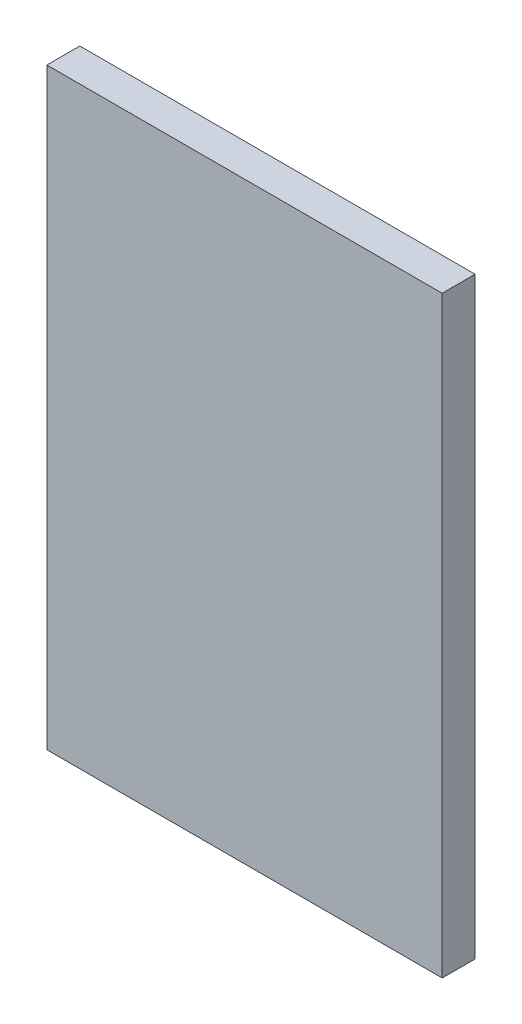
ISO-10303-21;
HEADER;
FILE_DESCRIPTION(('STEP AP214'),'2;1');
FILE_NAME('part.step','',(''),(''),'','','');
FILE_SCHEMA(('AUTOMOTIVE_DESIGN { 1 0 10303 214 1 1 1 1 }'));
ENDSEC;
DATA;
#1=APPLICATION_CONTEXT('core data for automotive mechanical design processes');
#2=APPLICATION_PROTOCOL_DEFINITION('international standard','automotive_design',2000,#1);
#3=PRODUCT_CONTEXT('',#1,'mechanical');
#4=PRODUCT('Part','Part','',(#3));
#5=PRODUCT_RELATED_PRODUCT_CATEGORY('part','',(#4));
#6=PRODUCT_DEFINITION_FORMATION('','',#4);
#7=PRODUCT_DEFINITION_CONTEXT('part definition',#1,'design');
#8=PRODUCT_DEFINITION('design','',#6,#7);
#9=PRODUCT_DEFINITION_SHAPE('','',#8);
#10=(LENGTH_UNIT() NAMED_UNIT(*) SI_UNIT(.MILLI.,.METRE.));
#11=(NAMED_UNIT(*) PLANE_ANGLE_UNIT() SI_UNIT($,.RADIAN.));
#12=(NAMED_UNIT(*) SI_UNIT($,.STERADIAN.) SOLID_ANGLE_UNIT());
#13=UNCERTAINTY_MEASURE_WITH_UNIT(LENGTH_MEASURE(1.E-05),#10,'distance_accuracy_value','');
#14=(GEOMETRIC_REPRESENTATION_CONTEXT(3) GLOBAL_UNCERTAINTY_ASSIGNED_CONTEXT((#13)) GLOBAL_UNIT_ASSIGNED_CONTEXT((#10,
#11,#12)) REPRESENTATION_CONTEXT('',''));
#15=CARTESIAN_POINT('',(0.,0.,0.));
#16=DIRECTION('',(0.,0.,1.));
#17=DIRECTION('',(1.,0.,0.));
#18=AXIS2_PLACEMENT_3D('',#15,#16,#17);
#19=CARTESIAN_POINT('',(30.,-45.,5.));
#20=DIRECTION('',(-1.,0.,0.));
#21=DIRECTION('',(0.,0.,1.));
#22=AXIS2_PLACEMENT_3D('',#19,#20,#21);
#23=PLANE('',#22);
#24=DIRECTION('',(0.,1.,0.));
#25=VECTOR('',#24,1.);
#26=CARTESIAN_POINT('',(30.,-45.,0.));
#27=LINE('',#26,#25);
#28=CARTESIAN_POINT('',(30.,-45.,0.));
#29=VERTEX_POINT('',#28);
#30=CARTESIAN_POINT('',(30.,45.,0.));
#31=VERTEX_POINT('',#30);
#32=EDGE_CURVE('E101',#29,#31,#27,.T.);
#33=ORIENTED_EDGE('',*,*,#32,.T.);
#34=DIRECTION('',(0.,0.,-1.));
#35=VECTOR('',#34,1.);
#36=CARTESIAN_POINT('',(30.,45.,5.));
#37=LINE('',#36,#35);
#38=CARTESIAN_POINT('',(30.,45.,5.));
#39=VERTEX_POINT('',#38);
#40=EDGE_CURVE('E11',#39,#31,#37,.T.);
#41=ORIENTED_EDGE('',*,*,#40,.F.);
#42=DIRECTION('',(0.,1.,0.));
#43=VECTOR('',#42,1.);
#44=CARTESIAN_POINT('',(30.,-45.,5.));
#45=LINE('',#44,#43);
#46=CARTESIAN_POINT('',(30.,-45.,5.));
#47=VERTEX_POINT('',#46);
#48=EDGE_CURVE('E89',#47,#39,#45,.T.);
#49=ORIENTED_EDGE('',*,*,#48,.F.);
#50=DIRECTION('',(0.,0.,-1.));
#51=VECTOR('',#50,1.);
#52=CARTESIAN_POINT('',(30.,-45.,5.));
#53=LINE('',#52,#51);
#54=EDGE_CURVE('E97',#47,#29,#53,.T.);
#55=ORIENTED_EDGE('',*,*,#54,.T.);
#56=EDGE_LOOP('',(#33,#41,#49,#55));
#57=FACE_BOUND('',#56,.T.);
#58=ADVANCED_FACE('F38',(#57),#23,.F.);
#59=CARTESIAN_POINT('',(-30.,45.,5.));
#60=DIRECTION('',(0.,-1.,0.));
#61=DIRECTION('',(0.,0.,-1.));
#62=AXIS2_PLACEMENT_3D('',#59,#60,#61);
#63=PLANE('',#62);
#64=DIRECTION('',(-1.,0.,0.));
#65=VECTOR('',#64,1.);
#66=CARTESIAN_POINT('',(-30.,45.,0.));
#67=LINE('',#66,#65);
#68=CARTESIAN_POINT('',(-30.,45.,0.));
#69=VERTEX_POINT('',#68);
#70=EDGE_CURVE('E93',#31,#69,#67,.T.);
#71=ORIENTED_EDGE('',*,*,#70,.T.);
#72=DIRECTION('',(0.,0.,-1.));
#73=VECTOR('',#72,1.);
#74=CARTESIAN_POINT('',(-30.,45.,5.));
#75=LINE('',#74,#73);
#76=CARTESIAN_POINT('',(-30.,45.,5.));
#77=VERTEX_POINT('',#76);
#78=EDGE_CURVE('E46',#77,#69,#75,.T.);
#79=ORIENTED_EDGE('',*,*,#78,.F.);
#80=DIRECTION('',(-1.,0.,0.));
#81=VECTOR('',#80,1.);
#82=CARTESIAN_POINT('',(-30.,45.,5.));
#83=LINE('',#82,#81);
#84=EDGE_CURVE('E84',#39,#77,#83,.T.);
#85=ORIENTED_EDGE('',*,*,#84,.F.);
#86=ORIENTED_EDGE('',*,*,#40,.T.);
#87=EDGE_LOOP('',(#71,#79,#85,#86));
#88=FACE_BOUND('',#87,.T.);
#89=ADVANCED_FACE('F92',(#88),#63,.F.);
#90=CARTESIAN_POINT('',(-30.,-45.,5.));
#91=DIRECTION('',(1.,0.,0.));
#92=DIRECTION('',(0.,0.,-1.));
#93=AXIS2_PLACEMENT_3D('',#90,#91,#92);
#94=PLANE('',#93);
#95=DIRECTION('',(0.,-1.,0.));
#96=VECTOR('',#95,1.);
#97=CARTESIAN_POINT('',(-30.,-45.,0.));
#98=LINE('',#97,#96);
#99=CARTESIAN_POINT('',(-30.,-45.,0.));
#100=VERTEX_POINT('',#99);
#101=EDGE_CURVE('E71',#69,#100,#98,.T.);
#102=ORIENTED_EDGE('',*,*,#101,.T.);
#103=DIRECTION('',(0.,0.,-1.));
#104=VECTOR('',#103,1.);
#105=CARTESIAN_POINT('',(-30.,-45.,5.));
#106=LINE('',#105,#104);
#107=CARTESIAN_POINT('',(-30.,-45.,5.));
#108=VERTEX_POINT('',#107);
#109=EDGE_CURVE('E94',#108,#100,#106,.T.);
#110=ORIENTED_EDGE('',*,*,#109,.F.);
#111=DIRECTION('',(0.,-1.,0.));
#112=VECTOR('',#111,1.);
#113=CARTESIAN_POINT('',(-30.,-45.,5.));
#114=LINE('',#113,#112);
#115=EDGE_CURVE('E87',#77,#108,#114,.T.);
#116=ORIENTED_EDGE('',*,*,#115,.F.);
#117=ORIENTED_EDGE('',*,*,#78,.T.);
#118=EDGE_LOOP('',(#102,#110,#116,#117));
#119=FACE_BOUND('',#118,.T.);
#120=ADVANCED_FACE('F95',(#119),#94,.F.);
#121=CARTESIAN_POINT('',(-30.,-45.,5.));
#122=DIRECTION('',(0.,1.,0.));
#123=DIRECTION('',(0.,0.,1.));
#124=AXIS2_PLACEMENT_3D('',#121,#122,#123);
#125=PLANE('',#124);
#126=DIRECTION('',(1.,0.,0.));
#127=VECTOR('',#126,1.);
#128=CARTESIAN_POINT('',(-30.,-45.,0.));
#129=LINE('',#128,#127);
#130=EDGE_CURVE('E77',#100,#29,#129,.T.);
#131=ORIENTED_EDGE('',*,*,#130,.T.);
#132=ORIENTED_EDGE('',*,*,#54,.F.);
#133=DIRECTION('',(1.,0.,0.));
#134=VECTOR('',#133,1.);
#135=CARTESIAN_POINT('',(-30.,-45.,5.));
#136=LINE('',#135,#134);
#137=EDGE_CURVE('E54',#108,#47,#136,.T.);
#138=ORIENTED_EDGE('',*,*,#137,.F.);
#139=ORIENTED_EDGE('',*,*,#109,.T.);
#140=EDGE_LOOP('',(#131,#132,#138,#139));
#141=FACE_BOUND('',#140,.T.);
#142=ADVANCED_FACE('F108',(#141),#125,.F.);
#143=CARTESIAN_POINT('',(0.,0.,5.));
#144=DIRECTION('',(0.,0.,-1.));
#145=DIRECTION('',(-1.,0.,0.));
#146=AXIS2_PLACEMENT_3D('',#143,#144,#145);
#147=PLANE('',#146);
#148=ORIENTED_EDGE('',*,*,#48,.T.);
#149=ORIENTED_EDGE('',*,*,#84,.T.);
#150=ORIENTED_EDGE('',*,*,#115,.T.);
#151=ORIENTED_EDGE('',*,*,#137,.T.);
#152=EDGE_LOOP('',(#148,#149,#150,#151));
#153=FACE_BOUND('',#152,.T.);
#154=ADVANCED_FACE('F85',(#153),#147,.F.);
#155=CARTESIAN_POINT('',(0.,0.,0.));
#156=DIRECTION('',(0.,0.,-1.));
#157=DIRECTION('',(-1.,0.,0.));
#158=AXIS2_PLACEMENT_3D('',#155,#156,#157);
#159=PLANE('',#158);
#160=ORIENTED_EDGE('',*,*,#32,.F.);
#161=ORIENTED_EDGE('',*,*,#130,.F.);
#162=ORIENTED_EDGE('',*,*,#101,.F.);
#163=ORIENTED_EDGE('',*,*,#70,.F.);
#164=EDGE_LOOP('',(#160,#161,#162,#163));
#165=FACE_BOUND('',#164,.T.);
#166=ADVANCED_FACE('F111',(#165),#159,.T.);
#167=CLOSED_SHELL('',(#58,#89,#120,#142,#154,#166));
#168=MANIFOLD_SOLID_BREP('B2',#167);
#169=ADVANCED_BREP_SHAPE_REPRESENTATION('',(#18,#168),#14);
#170=SHAPE_DEFINITION_REPRESENTATION(#9,#169);
ENDSEC;
END-ISO-10303-21;
